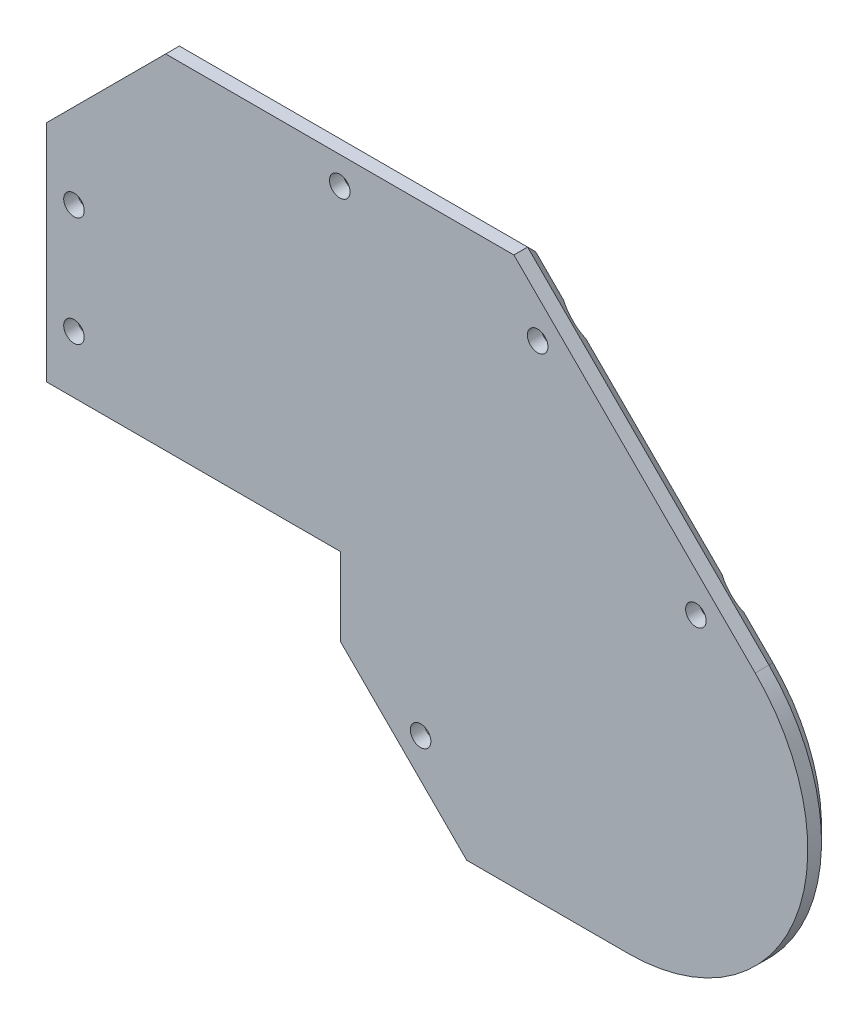
ISO-10303-21;
HEADER;
FILE_DESCRIPTION(('STEP AP214'),'2;1');
FILE_NAME('part.step','',(''),(''),'','','');
FILE_SCHEMA(('AUTOMOTIVE_DESIGN { 1 0 10303 214 1 1 1 1 }'));
ENDSEC;
DATA;
#1=APPLICATION_CONTEXT('core data for automotive mechanical design processes');
#2=APPLICATION_PROTOCOL_DEFINITION('international standard','automotive_design',2000,#1);
#3=PRODUCT_CONTEXT('',#1,'mechanical');
#4=PRODUCT('Part','Part','',(#3));
#5=PRODUCT_RELATED_PRODUCT_CATEGORY('part','',(#4));
#6=PRODUCT_DEFINITION_FORMATION('','',#4);
#7=PRODUCT_DEFINITION_CONTEXT('part definition',#1,'design');
#8=PRODUCT_DEFINITION('design','',#6,#7);
#9=PRODUCT_DEFINITION_SHAPE('','',#8);
#10=(LENGTH_UNIT() NAMED_UNIT(*) SI_UNIT(.MILLI.,.METRE.));
#11=(NAMED_UNIT(*) PLANE_ANGLE_UNIT() SI_UNIT($,.RADIAN.));
#12=(NAMED_UNIT(*) SI_UNIT($,.STERADIAN.) SOLID_ANGLE_UNIT());
#13=UNCERTAINTY_MEASURE_WITH_UNIT(LENGTH_MEASURE(1.E-05),#10,'distance_accuracy_value','');
#14=(GEOMETRIC_REPRESENTATION_CONTEXT(3) GLOBAL_UNCERTAINTY_ASSIGNED_CONTEXT((#13)) GLOBAL_UNIT_ASSIGNED_CONTEXT((#10,
#11,#12)) REPRESENTATION_CONTEXT('',''));
#15=CARTESIAN_POINT('',(0.,0.,0.));
#16=DIRECTION('',(0.,0.,1.));
#17=DIRECTION('',(1.,0.,0.));
#18=AXIS2_PLACEMENT_3D('',#15,#16,#17);
#19=CARTESIAN_POINT('',(91.5686996380855,17.926841446616,-4.));
#20=DIRECTION('',(0.,0.,1.));
#21=DIRECTION('',(1.,0.,0.));
#22=AXIS2_PLACEMENT_3D('',#19,#20,#21);
#23=CYLINDRICAL_SURFACE('',#22,1.5);
#24=CARTESIAN_POINT('',(91.5686996380855,17.926841446616,0.));
#25=DIRECTION('',(0.,0.,-1.));
#26=DIRECTION('',(-1.,0.,0.));
#27=AXIS2_PLACEMENT_3D('',#24,#25,#26);
#28=CIRCLE('',#27,1.5);
#29=CARTESIAN_POINT('',(90.0686996380855,17.926841446616,0.));
#30=VERTEX_POINT('',#29);
#31=EDGE_CURVE('E354',#30,#30,#28,.T.);
#32=ORIENTED_EDGE('',*,*,#31,.F.);
#33=EDGE_LOOP('',(#32));
#34=FACE_BOUND('',#33,.T.);
#35=CARTESIAN_POINT('',(91.5686996380855,17.926841446616,-2.));
#36=DIRECTION('',(0.,0.,-1.));
#37=DIRECTION('',(-1.,0.,0.));
#38=AXIS2_PLACEMENT_3D('',#35,#36,#37);
#39=CIRCLE('',#38,1.5);
#40=CARTESIAN_POINT('',(90.0686996380855,17.926841446616,-2.));
#41=VERTEX_POINT('',#40);
#42=EDGE_CURVE('E37',#41,#41,#39,.T.);
#43=ORIENTED_EDGE('',*,*,#42,.T.);
#44=EDGE_LOOP('',(#43));
#45=FACE_BOUND('',#44,.T.);
#46=ADVANCED_FACE('F33',(#34,#45),#23,.F.);
#47=CARTESIAN_POINT('',(51.3882684270139,-17.4117315730127,-4.));
#48=DIRECTION('',(0.,0.,1.));
#49=DIRECTION('',(1.,0.,0.));
#50=AXIS2_PLACEMENT_3D('',#47,#48,#49);
#51=CYLINDRICAL_SURFACE('',#50,1.5);
#52=CARTESIAN_POINT('',(51.3882684270139,-17.4117315730127,0.));
#53=DIRECTION('',(0.,0.,-1.));
#54=DIRECTION('',(-1.,0.,0.));
#55=AXIS2_PLACEMENT_3D('',#52,#53,#54);
#56=CIRCLE('',#55,1.5);
#57=CARTESIAN_POINT('',(49.8882684270139,-17.4117315730127,0.));
#58=VERTEX_POINT('',#57);
#59=EDGE_CURVE('E342',#58,#58,#56,.T.);
#60=ORIENTED_EDGE('',*,*,#59,.F.);
#61=EDGE_LOOP('',(#60));
#62=FACE_BOUND('',#61,.T.);
#63=CARTESIAN_POINT('',(51.3882684270139,-17.4117315730127,-2.));
#64=DIRECTION('',(0.,0.,-1.));
#65=DIRECTION('',(-1.,0.,0.));
#66=AXIS2_PLACEMENT_3D('',#63,#64,#65);
#67=CIRCLE('',#66,1.5);
#68=CARTESIAN_POINT('',(49.8882684270139,-17.4117315730127,-2.));
#69=VERTEX_POINT('',#68);
#70=EDGE_CURVE('E298',#69,#69,#67,.T.);
#71=ORIENTED_EDGE('',*,*,#70,.T.);
#72=EDGE_LOOP('',(#71));
#73=FACE_BOUND('',#72,.T.);
#74=ADVANCED_FACE('F462',(#62,#73),#51,.F.);
#75=CARTESIAN_POINT('',(68.4726534900144,41.022887594687,-4.));
#76=DIRECTION('',(0.,0.,1.));
#77=DIRECTION('',(1.,0.,0.));
#78=AXIS2_PLACEMENT_3D('',#75,#76,#77);
#79=CYLINDRICAL_SURFACE('',#78,1.5);
#80=CARTESIAN_POINT('',(68.4726534900144,41.022887594687,0.));
#81=DIRECTION('',(0.,0.,-1.));
#82=DIRECTION('',(-1.,0.,0.));
#83=AXIS2_PLACEMENT_3D('',#80,#81,#82);
#84=CIRCLE('',#83,1.5);
#85=CARTESIAN_POINT('',(66.9726534900144,41.022887594687,0.));
#86=VERTEX_POINT('',#85);
#87=EDGE_CURVE('E351',#86,#86,#84,.T.);
#88=ORIENTED_EDGE('',*,*,#87,.F.);
#89=EDGE_LOOP('',(#88));
#90=FACE_BOUND('',#89,.T.);
#91=CARTESIAN_POINT('',(68.4726534900144,41.022887594687,-2.));
#92=DIRECTION('',(0.,0.,-1.));
#93=DIRECTION('',(-1.,0.,0.));
#94=AXIS2_PLACEMENT_3D('',#91,#92,#93);
#95=CIRCLE('',#94,1.5);
#96=CARTESIAN_POINT('',(66.9726534900144,41.022887594687,-2.));
#97=VERTEX_POINT('',#96);
#98=EDGE_CURVE('E292',#97,#97,#95,.T.);
#99=ORIENTED_EDGE('',*,*,#98,.T.);
#100=EDGE_LOOP('',(#99));
#101=FACE_BOUND('',#100,.T.);
#102=ADVANCED_FACE('F469',(#90,#101),#79,.F.);
#103=CARTESIAN_POINT('',(39.5924878405,46.1490147738,-4.));
#104=DIRECTION('',(0.,0.,1.));
#105=DIRECTION('',(1.,0.,0.));
#106=AXIS2_PLACEMENT_3D('',#103,#104,#105);
#107=CYLINDRICAL_SURFACE('',#106,1.5);
#108=CARTESIAN_POINT('',(39.5924878405,46.1490147738,0.));
#109=DIRECTION('',(0.,0.,-1.));
#110=DIRECTION('',(-1.,0.,0.));
#111=AXIS2_PLACEMENT_3D('',#108,#109,#110);
#112=CIRCLE('',#111,1.5);
#113=CARTESIAN_POINT('',(38.0924878405,46.1490147738,0.));
#114=VERTEX_POINT('',#113);
#115=EDGE_CURVE('E348',#114,#114,#112,.T.);
#116=ORIENTED_EDGE('',*,*,#115,.F.);
#117=EDGE_LOOP('',(#116));
#118=FACE_BOUND('',#117,.T.);
#119=CARTESIAN_POINT('',(39.5924878405,46.1490147738,-2.));
#120=DIRECTION('',(0.,0.,-1.));
#121=DIRECTION('',(-1.,0.,0.));
#122=AXIS2_PLACEMENT_3D('',#119,#120,#121);
#123=CIRCLE('',#122,1.5);
#124=CARTESIAN_POINT('',(38.0924878405,46.1490147738,-2.));
#125=VERTEX_POINT('',#124);
#126=EDGE_CURVE('E286',#125,#125,#123,.T.);
#127=ORIENTED_EDGE('',*,*,#126,.T.);
#128=EDGE_LOOP('',(#127));
#129=FACE_BOUND('',#128,.T.);
#130=ADVANCED_FACE('F608',(#118,#129),#107,.F.);
#131=CARTESIAN_POINT('',(0.8,8.38370982659695,-4.));
#132=DIRECTION('',(0.,0.,1.));
#133=DIRECTION('',(1.,0.,0.));
#134=AXIS2_PLACEMENT_3D('',#131,#132,#133);
#135=CYLINDRICAL_SURFACE('',#134,1.5);
#136=CARTESIAN_POINT('',(0.8,8.38370982659695,0.));
#137=DIRECTION('',(0.,0.,-1.));
#138=DIRECTION('',(-1.,0.,0.));
#139=AXIS2_PLACEMENT_3D('',#136,#137,#138);
#140=CIRCLE('',#139,1.5);
#141=CARTESIAN_POINT('',(-0.699999999999999,8.38370982659695,0.));
#142=VERTEX_POINT('',#141);
#143=EDGE_CURVE('E269',#142,#142,#140,.T.);
#144=ORIENTED_EDGE('',*,*,#143,.F.);
#145=EDGE_LOOP('',(#144));
#146=FACE_BOUND('',#145,.T.);
#147=CARTESIAN_POINT('',(0.8,8.38370982659695,-2.));
#148=DIRECTION('',(0.,0.,-1.));
#149=DIRECTION('',(-1.,0.,0.));
#150=AXIS2_PLACEMENT_3D('',#147,#148,#149);
#151=CIRCLE('',#150,1.5);
#152=CARTESIAN_POINT('',(-0.699999999999999,8.38370982659695,-2.));
#153=VERTEX_POINT('',#152);
#154=EDGE_CURVE('E279',#153,#153,#151,.T.);
#155=ORIENTED_EDGE('',*,*,#154,.T.);
#156=EDGE_LOOP('',(#155));
#157=FACE_BOUND('',#156,.T.);
#158=ADVANCED_FACE('F457',(#146,#157),#135,.F.);
#159=CARTESIAN_POINT('',(0.8,24.383709826597,-4.));
#160=DIRECTION('',(0.,0.,1.));
#161=DIRECTION('',(1.,0.,0.));
#162=AXIS2_PLACEMENT_3D('',#159,#160,#161);
#163=CYLINDRICAL_SURFACE('',#162,1.5);
#164=CARTESIAN_POINT('',(0.8,24.383709826597,0.));
#165=DIRECTION('',(0.,0.,-1.));
#166=DIRECTION('',(-1.,0.,0.));
#167=AXIS2_PLACEMENT_3D('',#164,#165,#166);
#168=CIRCLE('',#167,1.5);
#169=CARTESIAN_POINT('',(-0.7,24.383709826597,0.));
#170=VERTEX_POINT('',#169);
#171=EDGE_CURVE('E345',#170,#170,#168,.T.);
#172=ORIENTED_EDGE('',*,*,#171,.F.);
#173=EDGE_LOOP('',(#172));
#174=FACE_BOUND('',#173,.T.);
#175=CARTESIAN_POINT('',(0.8,24.383709826597,-2.));
#176=DIRECTION('',(0.,0.,-1.));
#177=DIRECTION('',(-1.,0.,0.));
#178=AXIS2_PLACEMENT_3D('',#175,#176,#177);
#179=CIRCLE('',#178,1.5);
#180=CARTESIAN_POINT('',(-0.7,24.383709826597,-2.));
#181=VERTEX_POINT('',#180);
#182=EDGE_CURVE('E272',#181,#181,#179,.T.);
#183=ORIENTED_EDGE('',*,*,#182,.T.);
#184=EDGE_LOOP('',(#183));
#185=FACE_BOUND('',#184,.T.);
#186=ADVANCED_FACE('F450',(#174,#185),#163,.F.);
#187=CARTESIAN_POINT('',(39.,0.,48.));
#188=DIRECTION('',(0.,1.,0.));
#189=DIRECTION('',(0.,0.,1.));
#190=AXIS2_PLACEMENT_3D('',#187,#188,#189);
#191=PLANE('',#190);
#192=DIRECTION('',(0.,0.,-1.));
#193=VECTOR('',#192,1.);
#194=CARTESIAN_POINT('',(39.7000000000247,0.,48.));
#195=LINE('',#194,#193);
#196=CARTESIAN_POINT('',(39.7000000000247,0.,0.));
#197=VERTEX_POINT('',#196);
#198=CARTESIAN_POINT('',(39.7000000000247,0.,-2.));
#199=VERTEX_POINT('',#198);
#200=EDGE_CURVE('E183',#197,#199,#195,.T.);
#201=ORIENTED_EDGE('',*,*,#200,.F.);
#202=DIRECTION('',(1.,0.,0.));
#203=VECTOR('',#202,1.);
#204=CARTESIAN_POINT('',(-3.2,0.,0.));
#205=LINE('',#204,#203);
#206=CARTESIAN_POINT('',(-3.2,0.,0.));
#207=VERTEX_POINT('',#206);
#208=EDGE_CURVE('E335',#207,#197,#205,.T.);
#209=ORIENTED_EDGE('',*,*,#208,.F.);
#210=DIRECTION('',(0.,0.,-1.));
#211=VECTOR('',#210,1.);
#212=CARTESIAN_POINT('',(-3.2,0.,48.));
#213=LINE('',#212,#211);
#214=CARTESIAN_POINT('',(-3.2,0.,-2.));
#215=VERTEX_POINT('',#214);
#216=EDGE_CURVE('E357',#207,#215,#213,.T.);
#217=ORIENTED_EDGE('',*,*,#216,.T.);
#218=DIRECTION('',(1.,0.,0.));
#219=VECTOR('',#218,1.);
#220=CARTESIAN_POINT('',(39.7000000000247,0.,-2.));
#221=LINE('',#220,#219);
#222=EDGE_CURVE('E224',#215,#199,#221,.T.);
#223=ORIENTED_EDGE('',*,*,#222,.T.);
#224=EDGE_LOOP('',(#201,#209,#217,#223));
#225=FACE_BOUND('',#224,.T.);
#226=ADVANCED_FACE('F447',(#225),#191,.F.);
#227=CARTESIAN_POINT('',(39.7000000000247,0.,48.));
#228=DIRECTION('',(1.,0.,0.));
#229=DIRECTION('',(0.,0.,-1.));
#230=AXIS2_PLACEMENT_3D('',#227,#228,#229);
#231=PLANE('',#230);
#232=DIRECTION('',(0.,0.,-1.));
#233=VECTOR('',#232,1.);
#234=CARTESIAN_POINT('',(39.7000000000247,-11.3803173955159,48.));
#235=LINE('',#234,#233);
#236=CARTESIAN_POINT('',(39.7000000000247,-11.3803173955159,0.));
#237=VERTEX_POINT('',#236);
#238=CARTESIAN_POINT('',(39.7000000000247,-11.3803173955159,-2.));
#239=VERTEX_POINT('',#238);
#240=EDGE_CURVE('E186',#237,#239,#235,.T.);
#241=ORIENTED_EDGE('',*,*,#240,.F.);
#242=DIRECTION('',(0.,-1.,0.));
#243=VECTOR('',#242,1.);
#244=CARTESIAN_POINT('',(39.7000000000247,0.,0.));
#245=LINE('',#244,#243);
#246=EDGE_CURVE('E333',#197,#237,#245,.T.);
#247=ORIENTED_EDGE('',*,*,#246,.F.);
#248=ORIENTED_EDGE('',*,*,#200,.T.);
#249=DIRECTION('',(0.,-1.,0.));
#250=VECTOR('',#249,1.);
#251=CARTESIAN_POINT('',(39.7000000000247,-11.3803173955159,-2.));
#252=LINE('',#251,#250);
#253=EDGE_CURVE('E227',#199,#239,#252,.T.);
#254=ORIENTED_EDGE('',*,*,#253,.T.);
#255=EDGE_LOOP('',(#241,#247,#248,#254));
#256=FACE_BOUND('',#255,.T.);
#257=ADVANCED_FACE('F382',(#256),#231,.F.);
#258=CARTESIAN_POINT('',(50.1824243043077,-21.8627416997989,48.));
#259=DIRECTION('',(0.707106781186548,0.707106781186547,0.));
#260=DIRECTION('',(-0.707106781186547,0.707106781186548,0.));
#261=AXIS2_PLACEMENT_3D('',#258,#259,#260);
#262=PLANE('',#261);
#263=DIRECTION('',(0.,0.,-1.));
#264=VECTOR('',#263,1.);
#265=CARTESIAN_POINT('',(58.1196826045108,-29.800000000002,48.));
#266=LINE('',#265,#264);
#267=CARTESIAN_POINT('',(58.1196826045108,-29.800000000002,0.));
#268=VERTEX_POINT('',#267);
#269=CARTESIAN_POINT('',(58.1196826045108,-29.800000000002,-2.));
#270=VERTEX_POINT('',#269);
#271=EDGE_CURVE('E369',#268,#270,#266,.T.);
#272=ORIENTED_EDGE('',*,*,#271,.F.);
#273=DIRECTION('',(0.707106781186548,-0.707106781186548,0.));
#274=VECTOR('',#273,1.);
#275=CARTESIAN_POINT('',(39.7000000000247,-11.3803173955159,0.));
#276=LINE('',#275,#274);
#277=EDGE_CURVE('E331',#237,#268,#276,.T.);
#278=ORIENTED_EDGE('',*,*,#277,.F.);
#279=ORIENTED_EDGE('',*,*,#240,.T.);
#280=DIRECTION('',(0.707106781186547,-0.707106781186548,0.));
#281=VECTOR('',#280,1.);
#282=CARTESIAN_POINT('',(58.1196826045108,-29.800000000002,-2.));
#283=LINE('',#282,#281);
#284=EDGE_CURVE('E230',#239,#270,#283,.T.);
#285=ORIENTED_EDGE('',*,*,#284,.T.);
#286=EDGE_LOOP('',(#272,#278,#279,#285));
#287=FACE_BOUND('',#286,.T.);
#288=ADVANCED_FACE('F375',(#287),#262,.F.);
#289=CARTESIAN_POINT('',(81.7000000000047,-29.800000000002,48.));
#290=DIRECTION('',(0.,1.,0.));
#291=DIRECTION('',(-1.,0.,0.));
#292=AXIS2_PLACEMENT_3D('',#289,#290,#291);
#293=PLANE('',#292);
#294=DIRECTION('',(0.,0.,-1.));
#295=VECTOR('',#294,1.);
#296=CARTESIAN_POINT('',(81.7000000000047,-29.800000000002,48.));
#297=LINE('',#296,#295);
#298=CARTESIAN_POINT('',(81.7000000000047,-29.800000000002,0.));
#299=VERTEX_POINT('',#298);
#300=CARTESIAN_POINT('',(81.7000000000047,-29.800000000002,-2.));
#301=VERTEX_POINT('',#300);
#302=EDGE_CURVE('E367',#299,#301,#297,.T.);
#303=ORIENTED_EDGE('',*,*,#302,.F.);
#304=DIRECTION('',(1.,0.,0.));
#305=VECTOR('',#304,1.);
#306=CARTESIAN_POINT('',(58.1196826045108,-29.800000000002,0.));
#307=LINE('',#306,#305);
#308=EDGE_CURVE('E329',#268,#299,#307,.T.);
#309=ORIENTED_EDGE('',*,*,#308,.F.);
#310=ORIENTED_EDGE('',*,*,#271,.T.);
#311=DIRECTION('',(1.,0.,0.));
#312=VECTOR('',#311,1.);
#313=CARTESIAN_POINT('',(81.7000000000047,-29.800000000002,-2.));
#314=LINE('',#313,#312);
#315=EDGE_CURVE('E233',#270,#301,#314,.T.);
#316=ORIENTED_EDGE('',*,*,#315,.T.);
#317=EDGE_LOOP('',(#303,#309,#310,#316));
#318=FACE_BOUND('',#317,.T.);
#319=ADVANCED_FACE('F398',(#318),#293,.F.);
#320=CARTESIAN_POINT('',(81.7000000000047,-3.59999999999532,48.));
#321=DIRECTION('',(0.,0.,-1.));
#322=DIRECTION('',(-1.,0.,0.));
#323=AXIS2_PLACEMENT_3D('',#320,#321,#322);
#324=CYLINDRICAL_SURFACE('',#323,26.2000000000067);
#325=DIRECTION('',(0.,0.,-1.));
#326=VECTOR('',#325,1.);
#327=CARTESIAN_POINT('',(100.226197667097,14.9261976670969,48.));
#328=LINE('',#327,#326);
#329=CARTESIAN_POINT('',(100.226197667097,14.9261976670969,0.));
#330=VERTEX_POINT('',#329);
#331=CARTESIAN_POINT('',(100.226197667097,14.9261976670969,-2.00000000000001));
#332=VERTEX_POINT('',#331);
#333=EDGE_CURVE('E365',#330,#332,#328,.T.);
#334=ORIENTED_EDGE('',*,*,#333,.F.);
#335=CARTESIAN_POINT('',(81.7000000000047,-3.59999999999532,0.));
#336=DIRECTION('',(0.,0.,-1.));
#337=DIRECTION('',(-1.,0.,0.));
#338=AXIS2_PLACEMENT_3D('',#335,#336,#337);
#339=CIRCLE('',#338,26.2000000000067);
#340=EDGE_CURVE('E327',#299,#330,#339,.F.);
#341=ORIENTED_EDGE('',*,*,#340,.F.);
#342=ORIENTED_EDGE('',*,*,#302,.T.);
#343=CARTESIAN_POINT('',(81.7000000000047,-3.59999999999532,-2.));
#344=DIRECTION('',(0.,0.,-1.));
#345=DIRECTION('',(-1.,0.,0.));
#346=AXIS2_PLACEMENT_3D('',#343,#344,#345);
#347=CIRCLE('',#346,26.2000000000067);
#348=EDGE_CURVE('E236',#301,#332,#347,.F.);
#349=ORIENTED_EDGE('',*,*,#348,.T.);
#350=EDGE_LOOP('',(#334,#341,#342,#349));
#351=FACE_BOUND('',#350,.T.);
#352=ADVANCED_FACE('F406',(#351),#324,.T.);
#353=CARTESIAN_POINT('',(100.226197667097,14.9261976670969,48.));
#354=DIRECTION('',(-0.707106781186548,-0.707106781186547,0.));
#355=DIRECTION('',(0.707106781186547,-0.707106781186548,0.));
#356=AXIS2_PLACEMENT_3D('',#353,#354,#355);
#357=PLANE('',#356);
#358=DIRECTION('',(0.,0.,-1.));
#359=VECTOR('',#358,1.);
#360=CARTESIAN_POINT('',(65.0033805603939,50.1490147738,48.));
#361=LINE('',#360,#359);
#362=CARTESIAN_POINT('',(65.0033805603939,50.1490147738,0.));
#363=VERTEX_POINT('',#362);
#364=CARTESIAN_POINT('',(65.0033805603939,50.1490147738,-2.00000000000001));
#365=VERTEX_POINT('',#364);
#366=EDGE_CURVE('E363',#363,#365,#361,.T.);
#367=ORIENTED_EDGE('',*,*,#366,.F.);
#368=DIRECTION('',(-0.707106781186547,0.707106781186548,0.));
#369=VECTOR('',#368,1.);
#370=CARTESIAN_POINT('',(100.226197667097,14.9261976670969,0.));
#371=LINE('',#370,#369);
#372=EDGE_CURVE('E247',#330,#363,#371,.T.);
#373=ORIENTED_EDGE('',*,*,#372,.F.);
#374=ORIENTED_EDGE('',*,*,#333,.T.);
#375=DIRECTION('',(-0.707106781186547,0.707106781186548,0.));
#376=VECTOR('',#375,1.);
#377=CARTESIAN_POINT('',(65.0033805603939,50.1490147738,-2.00000000000001));
#378=LINE('',#377,#376);
#379=EDGE_CURVE('E239',#332,#365,#378,.T.);
#380=ORIENTED_EDGE('',*,*,#379,.T.);
#381=EDGE_LOOP('',(#367,#373,#374,#380));
#382=FACE_BOUND('',#381,.T.);
#383=ADVANCED_FACE('F409',(#382),#357,.F.);
#384=CARTESIAN_POINT('',(50.1111403346,50.1490147738,48.));
#385=DIRECTION('',(0.,-1.,0.));
#386=DIRECTION('',(0.,0.,-1.));
#387=AXIS2_PLACEMENT_3D('',#384,#385,#386);
#388=PLANE('',#387);
#389=DIRECTION('',(0.,0.,-1.));
#390=VECTOR('',#389,1.);
#391=CARTESIAN_POINT('',(14.1815951206061,50.1490147738,48.));
#392=LINE('',#391,#390);
#393=CARTESIAN_POINT('',(14.1815951206061,50.1490147738,0.));
#394=VERTEX_POINT('',#393);
#395=CARTESIAN_POINT('',(14.1815951206061,50.1490147738,-2.));
#396=VERTEX_POINT('',#395);
#397=EDGE_CURVE('E361',#394,#396,#392,.T.);
#398=ORIENTED_EDGE('',*,*,#397,.F.);
#399=DIRECTION('',(-1.,0.,0.));
#400=VECTOR('',#399,1.);
#401=CARTESIAN_POINT('',(65.0033805603939,50.1490147738,0.));
#402=LINE('',#401,#400);
#403=EDGE_CURVE('E275',#363,#394,#402,.T.);
#404=ORIENTED_EDGE('',*,*,#403,.F.);
#405=ORIENTED_EDGE('',*,*,#366,.T.);
#406=DIRECTION('',(-1.,0.,0.));
#407=VECTOR('',#406,1.);
#408=CARTESIAN_POINT('',(14.1815951206061,50.1490147738,-2.));
#409=LINE('',#408,#407);
#410=EDGE_CURVE('E215',#365,#396,#409,.T.);
#411=ORIENTED_EDGE('',*,*,#410,.T.);
#412=EDGE_LOOP('',(#398,#404,#405,#411));
#413=FACE_BOUND('',#412,.T.);
#414=ADVANCED_FACE('F415',(#413),#388,.F.);
#415=CARTESIAN_POINT('',(-3.2,32.7674196531939,48.));
#416=DIRECTION('',(0.707106781186547,-0.707106781186547,0.));
#417=DIRECTION('',(0.707106781186548,0.707106781186548,0.));
#418=AXIS2_PLACEMENT_3D('',#415,#416,#417);
#419=PLANE('',#418);
#420=DIRECTION('',(0.,0.,-1.));
#421=VECTOR('',#420,1.);
#422=CARTESIAN_POINT('',(-3.2,32.7674196531939,48.));
#423=LINE('',#422,#421);
#424=CARTESIAN_POINT('',(-3.2,32.7674196531939,0.));
#425=VERTEX_POINT('',#424);
#426=CARTESIAN_POINT('',(-3.2,32.7674196531939,-2.));
#427=VERTEX_POINT('',#426);
#428=EDGE_CURVE('E359',#425,#427,#423,.T.);
#429=ORIENTED_EDGE('',*,*,#428,.F.);
#430=DIRECTION('',(-0.707106781186548,-0.707106781186548,0.));
#431=VECTOR('',#430,1.);
#432=CARTESIAN_POINT('',(14.1815951206061,50.1490147738,0.));
#433=LINE('',#432,#431);
#434=EDGE_CURVE('E325',#394,#425,#433,.T.);
#435=ORIENTED_EDGE('',*,*,#434,.F.);
#436=ORIENTED_EDGE('',*,*,#397,.T.);
#437=DIRECTION('',(-0.707106781186548,-0.707106781186548,0.));
#438=VECTOR('',#437,1.);
#439=CARTESIAN_POINT('',(-3.2,32.7674196531939,-2.));
#440=LINE('',#439,#438);
#441=EDGE_CURVE('E218',#396,#427,#440,.T.);
#442=ORIENTED_EDGE('',*,*,#441,.T.);
#443=EDGE_LOOP('',(#429,#435,#436,#442));
#444=FACE_BOUND('',#443,.T.);
#445=ADVANCED_FACE('F418',(#444),#419,.F.);
#446=CARTESIAN_POINT('',(-3.2,0.,48.));
#447=DIRECTION('',(1.,0.,0.));
#448=DIRECTION('',(0.,0.,-1.));
#449=AXIS2_PLACEMENT_3D('',#446,#447,#448);
#450=PLANE('',#449);
#451=ORIENTED_EDGE('',*,*,#216,.F.);
#452=DIRECTION('',(0.,-1.,0.));
#453=VECTOR('',#452,1.);
#454=CARTESIAN_POINT('',(-3.2,32.7674196531939,0.));
#455=LINE('',#454,#453);
#456=EDGE_CURVE('E337',#425,#207,#455,.T.);
#457=ORIENTED_EDGE('',*,*,#456,.F.);
#458=ORIENTED_EDGE('',*,*,#428,.T.);
#459=DIRECTION('',(0.,-1.,0.));
#460=VECTOR('',#459,1.);
#461=CARTESIAN_POINT('',(-3.2,0.,-2.));
#462=LINE('',#461,#460);
#463=EDGE_CURVE('E221',#427,#215,#462,.T.);
#464=ORIENTED_EDGE('',*,*,#463,.T.);
#465=EDGE_LOOP('',(#451,#457,#458,#464));
#466=FACE_BOUND('',#465,.T.);
#467=ADVANCED_FACE('F441',(#466),#450,.F.);
#468=CARTESIAN_POINT('',(81.7000000000047,-3.59999999999532,-4.));
#469=DIRECTION('',(0.,0.,-1.));
#470=DIRECTION('',(-1.,0.,0.));
#471=AXIS2_PLACEMENT_3D('',#468,#469,#470);
#472=PLANE('',#471);
#473=CARTESIAN_POINT('',(91.5686996380855,17.926841446616,-4.));
#474=DIRECTION('',(0.,0.,-1.));
#475=DIRECTION('',(-1.,0.,0.));
#476=AXIS2_PLACEMENT_3D('',#473,#474,#475);
#477=CIRCLE('',#476,3.00000000000001);
#478=CARTESIAN_POINT('',(94.5640520305428,17.7599161789049,-4.));
#479=VERTEX_POINT('',#478);
#480=CARTESIAN_POINT('',(91.4017743703744,20.9221938390733,-4.));
#481=VERTEX_POINT('',#480);
#482=EDGE_CURVE('E47',#479,#481,#477,.T.);
#483=ORIENTED_EDGE('',*,*,#482,.F.);
#484=DIRECTION('',(0.707106781186547,-0.707106781186548,0.));
#485=VECTOR('',#484,1.);
#486=CARTESIAN_POINT('',(98.8119841047239,13.5119841047238,-4.));
#487=LINE('',#486,#485);
#488=CARTESIAN_POINT('',(98.8119841047239,13.5119841047238,-4.));
#489=VERTEX_POINT('',#488);
#490=EDGE_CURVE('E172',#479,#489,#487,.T.);
#491=ORIENTED_EDGE('',*,*,#490,.T.);
#492=CARTESIAN_POINT('',(81.7000000000047,-3.59999999999532,-4.));
#493=DIRECTION('',(0.,0.,-1.));
#494=DIRECTION('',(-1.,0.,0.));
#495=AXIS2_PLACEMENT_3D('',#492,#493,#494);
#496=CIRCLE('',#495,24.2000000000067);
#497=CARTESIAN_POINT('',(81.7000000000047,-27.800000000002,-4.));
#498=VERTEX_POINT('',#497);
#499=EDGE_CURVE('E190',#489,#498,#496,.T.);
#500=ORIENTED_EDGE('',*,*,#499,.T.);
#501=DIRECTION('',(-1.,0.,0.));
#502=VECTOR('',#501,1.);
#503=CARTESIAN_POINT('',(58.1196826045108,-27.800000000002,-4.));
#504=LINE('',#503,#502);
#505=CARTESIAN_POINT('',(58.948109729257,-27.800000000002,-4.));
#506=VERTEX_POINT('',#505);
#507=EDGE_CURVE('E192',#498,#506,#504,.T.);
#508=ORIENTED_EDGE('',*,*,#507,.T.);
#509=DIRECTION('',(-0.707106781186547,0.707106781186548,0.));
#510=VECTOR('',#509,1.);
#511=CARTESIAN_POINT('',(41.1142135623978,-9.96610383314278,-4.));
#512=LINE('',#511,#510);
#513=CARTESIAN_POINT('',(51.555193694725,-20.40708396547,-4.));
#514=VERTEX_POINT('',#513);
#515=EDGE_CURVE('E197',#506,#514,#512,.T.);
#516=ORIENTED_EDGE('',*,*,#515,.T.);
#517=CARTESIAN_POINT('',(51.3882684270139,-17.4117315730127,-4.));
#518=DIRECTION('',(0.,0.,-1.));
#519=DIRECTION('',(-1.,0.,0.));
#520=AXIS2_PLACEMENT_3D('',#517,#518,#519);
#521=CIRCLE('',#520,3.);
#522=CARTESIAN_POINT('',(48.3929160345566,-17.2448063053017,-4.));
#523=VERTEX_POINT('',#522);
#524=EDGE_CURVE('E54',#523,#514,#521,.T.);
#525=ORIENTED_EDGE('',*,*,#524,.F.);
#526=CARTESIAN_POINT('',(41.7000000000247,-10.5518902707697,-4.));
#527=VERTEX_POINT('',#526);
#528=EDGE_CURVE('E194',#523,#527,#512,.T.);
#529=ORIENTED_EDGE('',*,*,#528,.T.);
#530=DIRECTION('',(0.,1.,0.));
#531=VECTOR('',#530,1.);
#532=CARTESIAN_POINT('',(41.7000000000247,0.,-4.));
#533=LINE('',#532,#531);
#534=CARTESIAN_POINT('',(41.7000000000247,2.,-4.));
#535=VERTEX_POINT('',#534);
#536=EDGE_CURVE('E200',#527,#535,#533,.T.);
#537=ORIENTED_EDGE('',*,*,#536,.T.);
#538=DIRECTION('',(-1.,0.,0.));
#539=VECTOR('',#538,1.);
#540=CARTESIAN_POINT('',(-3.2,2.,-4.));
#541=LINE('',#540,#539);
#542=CARTESIAN_POINT('',(-1.20000000000001,2.,-4.));
#543=VERTEX_POINT('',#542);
#544=EDGE_CURVE('E202',#535,#543,#541,.T.);
#545=ORIENTED_EDGE('',*,*,#544,.T.);
#546=DIRECTION('',(0.,1.,0.));
#547=VECTOR('',#546,1.);
#548=CARTESIAN_POINT('',(-1.20000000000001,32.7674196531939,-4.));
#549=LINE('',#548,#547);
#550=CARTESIAN_POINT('',(-1.20000000000001,6.14764184909717,-4.));
#551=VERTEX_POINT('',#550);
#552=EDGE_CURVE('E205',#543,#551,#549,.T.);
#553=ORIENTED_EDGE('',*,*,#552,.T.);
#554=CARTESIAN_POINT('',(0.8,8.38370982659695,-4.));
#555=DIRECTION('',(0.,0.,-1.));
#556=DIRECTION('',(-1.,0.,0.));
#557=AXIS2_PLACEMENT_3D('',#554,#555,#556);
#558=CIRCLE('',#557,3.);
#559=CARTESIAN_POINT('',(-1.20000000000001,10.6197778040967,-4.));
#560=VERTEX_POINT('',#559);
#561=EDGE_CURVE('E289',#560,#551,#558,.T.);
#562=ORIENTED_EDGE('',*,*,#561,.F.);
#563=CARTESIAN_POINT('',(-1.20000000000001,22.1476418490972,-4.));
#564=VERTEX_POINT('',#563);
#565=EDGE_CURVE('E209',#560,#564,#549,.T.);
#566=ORIENTED_EDGE('',*,*,#565,.T.);
#567=CARTESIAN_POINT('',(0.8,24.383709826597,-4.));
#568=DIRECTION('',(0.,0.,-1.));
#569=DIRECTION('',(-1.,0.,0.));
#570=AXIS2_PLACEMENT_3D('',#567,#568,#569);
#571=CIRCLE('',#570,3.);
#572=CARTESIAN_POINT('',(-1.20000000000001,26.6197778040967,-4.));
#573=VERTEX_POINT('',#572);
#574=EDGE_CURVE('E282',#573,#564,#571,.T.);
#575=ORIENTED_EDGE('',*,*,#574,.F.);
#576=CARTESIAN_POINT('',(-1.20000000000001,31.9389925284477,-4.));
#577=VERTEX_POINT('',#576);
#578=EDGE_CURVE('E204',#573,#577,#549,.T.);
#579=ORIENTED_EDGE('',*,*,#578,.T.);
#580=DIRECTION('',(0.707106781186548,0.707106781186548,0.));
#581=VECTOR('',#580,1.);
#582=CARTESIAN_POINT('',(15.5958086829792,48.7348012114269,-4.));
#583=LINE('',#582,#581);
#584=CARTESIAN_POINT('',(15.0100222453523,48.1490147738,-4.));
#585=VERTEX_POINT('',#584);
#586=EDGE_CURVE('E208',#577,#585,#583,.T.);
#587=ORIENTED_EDGE('',*,*,#586,.T.);
#588=DIRECTION('',(1.,0.,0.));
#589=VECTOR('',#588,1.);
#590=CARTESIAN_POINT('',(65.0033805603939,48.1490147738,-4.));
#591=LINE('',#590,#589);
#592=CARTESIAN_POINT('',(37.3564198630002,48.1490147738,-4.));
#593=VERTEX_POINT('',#592);
#594=EDGE_CURVE('E212',#585,#593,#591,.T.);
#595=ORIENTED_EDGE('',*,*,#594,.T.);
#596=CARTESIAN_POINT('',(39.5924878405,46.1490147738,-4.));
#597=DIRECTION('',(0.,0.,-1.));
#598=DIRECTION('',(-1.,0.,0.));
#599=AXIS2_PLACEMENT_3D('',#596,#597,#598);
#600=CIRCLE('',#599,3.);
#601=CARTESIAN_POINT('',(41.8285558179998,48.1490147738,-4.));
#602=VERTEX_POINT('',#601);
#603=EDGE_CURVE('E295',#602,#593,#600,.T.);
#604=ORIENTED_EDGE('',*,*,#603,.F.);
#605=CARTESIAN_POINT('',(64.1749534356477,48.1490147738,-4.));
#606=VERTEX_POINT('',#605);
#607=EDGE_CURVE('E211',#602,#606,#591,.T.);
#608=ORIENTED_EDGE('',*,*,#607,.T.);
#609=CARTESIAN_POINT('',(68.3057282223034,44.0182399871443,-4.));
#610=VERTEX_POINT('',#609);
#611=EDGE_CURVE('E185',#606,#610,#487,.T.);
#612=ORIENTED_EDGE('',*,*,#611,.T.);
#613=CARTESIAN_POINT('',(68.4726534900144,41.022887594687,-4.));
#614=DIRECTION('',(0.,0.,-1.));
#615=DIRECTION('',(-1.,0.,0.));
#616=AXIS2_PLACEMENT_3D('',#613,#614,#615);
#617=CIRCLE('',#616,3.00000000000001);
#618=CARTESIAN_POINT('',(71.4680058824717,40.855962326976,-4.));
#619=VERTEX_POINT('',#618);
#620=EDGE_CURVE('E300',#619,#610,#617,.T.);
#621=ORIENTED_EDGE('',*,*,#620,.F.);
#622=EDGE_CURVE('E175',#619,#481,#487,.T.);
#623=ORIENTED_EDGE('',*,*,#622,.T.);
#624=EDGE_LOOP('',(#483,#491,#500,#508,#516,#525,#529,#537,#545,#553,#562,#566,#575,#579,#587,
#595,#604,#608,#612,#621,#623));
#625=FACE_BOUND('',#624,.T.);
#626=ADVANCED_FACE('F171',(#625),#472,.T.);
#627=CARTESIAN_POINT('',(81.7000000000047,-3.59999999999532,0.));
#628=DIRECTION('',(0.,0.,-1.));
#629=DIRECTION('',(-1.,0.,0.));
#630=AXIS2_PLACEMENT_3D('',#627,#628,#629);
#631=PLANE('',#630);
#632=ORIENTED_EDGE('',*,*,#87,.T.);
#633=EDGE_LOOP('',(#632));
#634=FACE_BOUND('',#633,.T.);
#635=ORIENTED_EDGE('',*,*,#59,.T.);
#636=EDGE_LOOP('',(#635));
#637=FACE_BOUND('',#636,.T.);
#638=ORIENTED_EDGE('',*,*,#31,.T.);
#639=EDGE_LOOP('',(#638));
#640=FACE_BOUND('',#639,.T.);
#641=ORIENTED_EDGE('',*,*,#115,.T.);
#642=EDGE_LOOP('',(#641));
#643=FACE_BOUND('',#642,.T.);
#644=ORIENTED_EDGE('',*,*,#171,.T.);
#645=EDGE_LOOP('',(#644));
#646=FACE_BOUND('',#645,.T.);
#647=ORIENTED_EDGE('',*,*,#143,.T.);
#648=EDGE_LOOP('',(#647));
#649=FACE_BOUND('',#648,.T.);
#650=ORIENTED_EDGE('',*,*,#372,.T.);
#651=ORIENTED_EDGE('',*,*,#403,.T.);
#652=ORIENTED_EDGE('',*,*,#434,.T.);
#653=ORIENTED_EDGE('',*,*,#456,.T.);
#654=ORIENTED_EDGE('',*,*,#208,.T.);
#655=ORIENTED_EDGE('',*,*,#246,.T.);
#656=ORIENTED_EDGE('',*,*,#277,.T.);
#657=ORIENTED_EDGE('',*,*,#308,.T.);
#658=ORIENTED_EDGE('',*,*,#340,.T.);
#659=EDGE_LOOP('',(#650,#651,#652,#653,#654,#655,#656,#657,#658));
#660=FACE_BOUND('',#659,.T.);
#661=ADVANCED_FACE('F402',(#634,#637,#640,#643,#646,#649,#660),#631,.F.);
#662=CARTESIAN_POINT('',(41.7000000000247,-3.59999999999532,-4.));
#663=DIRECTION('',(-0.707106781186548,0.,-0.707106781186547));
#664=DIRECTION('',(0.,-1.,0.));
#665=AXIS2_PLACEMENT_3D('',#662,#663,#664);
#666=PLANE('',#665);
#667=DIRECTION('',(0.577350269189625,0.577350269189626,-0.577350269189626));
#668=VECTOR('',#667,1.);
#669=CARTESIAN_POINT('',(55.0333333333513,15.3333333333266,-17.3333333333267));
#670=LINE('',#669,#668);
#671=EDGE_CURVE('E263',#535,#199,#670,.F.);
#672=ORIENTED_EDGE('',*,*,#671,.F.);
#673=ORIENTED_EDGE('',*,*,#536,.F.);
#674=DIRECTION('',(0.678598344545847,0.281084637714819,-0.678598344545848));
#675=VECTOR('',#674,1.);
#676=CARTESIAN_POINT('',(46.1573992172422,-8.70557506208695,-8.45739921721757));
#677=LINE('',#676,#675);
#678=EDGE_CURVE('E266',#239,#527,#677,.T.);
#679=ORIENTED_EDGE('',*,*,#678,.F.);
#680=ORIENTED_EDGE('',*,*,#253,.F.);
#681=EDGE_LOOP('',(#672,#673,#679,#680));
#682=FACE_BOUND('',#681,.T.);
#683=ADVANCED_FACE('F35',(#682),#666,.T.);
#684=CARTESIAN_POINT('',(58.2240548646275,-27.0759451353725,-4.));
#685=DIRECTION('',(-0.500000000000001,-0.5,-0.707106781186546));
#686=DIRECTION('',(0.707106781186547,-0.707106781186548,0.));
#687=AXIS2_PLACEMENT_3D('',#684,#685,#686);
#688=PLANE('',#687);
#689=CARTESIAN_POINT('',(51.3882684270139,-17.4117315730127,-6.00000000000002));
#690=DIRECTION('',(-0.500000000000001,-0.5,-0.707106781186546));
#691=DIRECTION('',(0.5,0.499999999999999,-0.707106781186549));
#692=AXIS2_PLACEMENT_3D('',#689,#690,#691);
#693=ELLIPSE('',#692,4.24264068711929,3.);
#694=EDGE_CURVE('E42',#514,#523,#693,.T.);
#695=ORIENTED_EDGE('',*,*,#694,.F.);
#696=ORIENTED_EDGE('',*,*,#515,.F.);
#697=DIRECTION('',(0.281084637714819,0.678598344545846,-0.678598344545848));
#698=VECTOR('',#697,1.);
#699=CARTESIAN_POINT('',(60.7457041253258,-23.4602232293667,-8.33977677063528));
#700=LINE('',#699,#698);
#701=EDGE_CURVE('E260',#270,#506,#700,.T.);
#702=ORIENTED_EDGE('',*,*,#701,.F.);
#703=ORIENTED_EDGE('',*,*,#284,.F.);
#704=ORIENTED_EDGE('',*,*,#678,.T.);
#705=ORIENTED_EDGE('',*,*,#528,.F.);
#706=EDGE_LOOP('',(#695,#696,#702,#703,#704,#705));
#707=FACE_BOUND('',#706,.T.);
#708=ADVANCED_FACE('F389',(#707),#688,.T.);
#709=CARTESIAN_POINT('',(81.7000000000047,2.,-4.));
#710=DIRECTION('',(0.,-0.707106781186548,-0.707106781186547));
#711=DIRECTION('',(1.,0.,0.));
#712=AXIS2_PLACEMENT_3D('',#709,#710,#711);
#713=PLANE('',#712);
#714=ORIENTED_EDGE('',*,*,#671,.T.);
#715=ORIENTED_EDGE('',*,*,#222,.F.);
#716=DIRECTION('',(0.577350269189625,0.577350269189626,-0.577350269189627));
#717=VECTOR('',#716,1.);
#718=CARTESIAN_POINT('',(26.4333333333348,29.6333333333349,-31.6333333333349));
#719=LINE('',#718,#717);
#720=EDGE_CURVE('E257',#543,#215,#719,.F.);
#721=ORIENTED_EDGE('',*,*,#720,.F.);
#722=ORIENTED_EDGE('',*,*,#544,.F.);
#723=EDGE_LOOP('',(#714,#715,#721,#722));
#724=FACE_BOUND('',#723,.T.);
#725=ADVANCED_FACE('F444',(#724),#713,.T.);
#726=CARTESIAN_POINT('',(81.7000000000047,-27.800000000002,-4.));
#727=DIRECTION('',(0.,-0.707106781186548,-0.707106781186547));
#728=DIRECTION('',(1.,0.,0.));
#729=AXIS2_PLACEMENT_3D('',#726,#727,#728);
#730=PLANE('',#729);
#731=ORIENTED_EDGE('',*,*,#701,.T.);
#732=ORIENTED_EDGE('',*,*,#507,.F.);
#733=DIRECTION('',(0.,0.707106781186547,-0.707106781186548));
#734=VECTOR('',#733,1.);
#735=CARTESIAN_POINT('',(81.7000000000047,-29.800000000002,-2.));
#736=LINE('',#735,#734);
#737=EDGE_CURVE('E254',#301,#498,#736,.T.);
#738=ORIENTED_EDGE('',*,*,#737,.F.);
#739=ORIENTED_EDGE('',*,*,#315,.F.);
#740=EDGE_LOOP('',(#731,#732,#738,#739));
#741=FACE_BOUND('',#740,.T.);
#742=ADVANCED_FACE('F394',(#741),#730,.T.);
#743=CARTESIAN_POINT('',(-1.20000000000001,-3.59999999999532,-4.));
#744=DIRECTION('',(-0.707106781186548,0.,-0.707106781186547));
#745=DIRECTION('',(0.,-1.,0.));
#746=AXIS2_PLACEMENT_3D('',#743,#744,#745);
#747=PLANE('',#746);
#748=CARTESIAN_POINT('',(0.8,8.38370982659695,-6.00000000000001));
#749=DIRECTION('',(-0.707106781186548,0.,-0.707106781186547));
#750=DIRECTION('',(0.707106781186547,0.,-0.707106781186548));
#751=AXIS2_PLACEMENT_3D('',#748,#749,#750);
#752=ELLIPSE('',#751,4.24264068711929,3.);
#753=EDGE_CURVE('E271',#551,#560,#752,.T.);
#754=ORIENTED_EDGE('',*,*,#753,.F.);
#755=ORIENTED_EDGE('',*,*,#552,.F.);
#756=ORIENTED_EDGE('',*,*,#720,.T.);
#757=ORIENTED_EDGE('',*,*,#463,.F.);
#758=DIRECTION('',(0.678598344545845,-0.281084637714824,-0.678598344545847));
#759=VECTOR('',#758,1.);
#760=CARTESIAN_POINT('',(5.57883430305639,29.1311074230417,-10.7788343030564));
#761=LINE('',#760,#759);
#762=EDGE_CURVE('E251',#577,#427,#761,.F.);
#763=ORIENTED_EDGE('',*,*,#762,.F.);
#764=ORIENTED_EDGE('',*,*,#578,.F.);
#765=CARTESIAN_POINT('',(0.8,24.383709826597,-6.00000000000001));
#766=DIRECTION('',(-0.707106781186548,0.,-0.707106781186547));
#767=DIRECTION('',(0.707106781186547,0.,-0.707106781186548));
#768=AXIS2_PLACEMENT_3D('',#765,#766,#767);
#769=ELLIPSE('',#768,4.24264068711929,3.);
#770=EDGE_CURVE('E242',#564,#573,#769,.T.);
#771=ORIENTED_EDGE('',*,*,#770,.F.);
#772=ORIENTED_EDGE('',*,*,#565,.F.);
#773=EDGE_LOOP('',(#754,#755,#756,#757,#763,#764,#771,#772));
#774=FACE_BOUND('',#773,.T.);
#775=ADVANCED_FACE('F434',(#774),#747,.T.);
#776=CARTESIAN_POINT('',(81.7000000000047,-3.59999999999532,-4.));
#777=DIRECTION('',(0.,0.,1.));
#778=DIRECTION('',(1.,0.,0.));
#779=AXIS2_PLACEMENT_3D('',#776,#777,#778);
#780=CONICAL_SURFACE('',#779,24.2000000000067,0.785398163397447);
#781=ORIENTED_EDGE('',*,*,#737,.T.);
#782=ORIENTED_EDGE('',*,*,#499,.F.);
#783=DIRECTION('',(-0.499999999999999,-0.499999999999999,-0.707106781186549));
#784=VECTOR('',#783,1.);
#785=CARTESIAN_POINT('',(100.226197667097,14.9261976670969,-2.));
#786=LINE('',#785,#784);
#787=EDGE_CURVE('E182',#332,#489,#786,.T.);
#788=ORIENTED_EDGE('',*,*,#787,.F.);
#789=ORIENTED_EDGE('',*,*,#348,.F.);
#790=EDGE_LOOP('',(#781,#782,#788,#789));
#791=FACE_BOUND('',#790,.T.);
#792=ADVANCED_FACE('F565',(#791),#780,.T.);
#793=CARTESIAN_POINT('',(22.4805037357808,55.6194962642285,-4.));
#794=DIRECTION('',(-0.5,0.5,-0.707106781186548));
#795=DIRECTION('',(-0.707106781186548,-0.707106781186548,0.));
#796=AXIS2_PLACEMENT_3D('',#793,#794,#795);
#797=PLANE('',#796);
#798=ORIENTED_EDGE('',*,*,#762,.T.);
#799=ORIENTED_EDGE('',*,*,#441,.F.);
#800=DIRECTION('',(0.281084637714823,-0.678598344545846,-0.678598344545847));
#801=VECTOR('',#800,1.);
#802=CARTESIAN_POINT('',(14.1753080238746,50.164193167997,-1.98482160580296));
#803=LINE('',#802,#801);
#804=EDGE_CURVE('E246',#585,#396,#803,.F.);
#805=ORIENTED_EDGE('',*,*,#804,.F.);
#806=ORIENTED_EDGE('',*,*,#586,.F.);
#807=EDGE_LOOP('',(#798,#799,#805,#806));
#808=FACE_BOUND('',#807,.T.);
#809=ADVANCED_FACE('F429',(#808),#797,.T.);
#810=CARTESIAN_POINT('',(98.8119841047239,13.5119841047239,-4.));
#811=DIRECTION('',(0.5,0.5,-0.707106781186547));
#812=DIRECTION('',(-0.707106781186547,0.707106781186548,0.));
#813=AXIS2_PLACEMENT_3D('',#810,#811,#812);
#814=PLANE('',#813);
#815=CARTESIAN_POINT('',(91.5686996380855,17.926841446616,-5.99999999999999));
#816=DIRECTION('',(0.5,0.5,-0.707106781186547));
#817=DIRECTION('',(-0.5,-0.5,-0.707106781186548));
#818=AXIS2_PLACEMENT_3D('',#815,#816,#817);
#819=ELLIPSE('',#818,4.2426406871193,3.00000000000001);
#820=EDGE_CURVE('E11',#481,#479,#819,.T.);
#821=ORIENTED_EDGE('',*,*,#820,.F.);
#822=ORIENTED_EDGE('',*,*,#622,.F.);
#823=CARTESIAN_POINT('',(68.4726534900144,41.022887594687,-6.00000000000004));
#824=DIRECTION('',(0.5,0.5,-0.707106781186547));
#825=DIRECTION('',(-0.5,-0.5,-0.707106781186548));
#826=AXIS2_PLACEMENT_3D('',#823,#824,#825);
#827=ELLIPSE('',#826,4.2426406871193,3.00000000000001);
#828=EDGE_CURVE('E285',#610,#619,#827,.T.);
#829=ORIENTED_EDGE('',*,*,#828,.F.);
#830=ORIENTED_EDGE('',*,*,#611,.F.);
#831=DIRECTION('',(0.28108463771482,0.678598344545846,0.678598344545848));
#832=VECTOR('',#831,1.);
#833=CARTESIAN_POINT('',(60.3047849429905,38.8056015101579,-13.3434132636421));
#834=LINE('',#833,#832);
#835=EDGE_CURVE('E243',#365,#606,#834,.F.);
#836=ORIENTED_EDGE('',*,*,#835,.F.);
#837=ORIENTED_EDGE('',*,*,#379,.F.);
#838=ORIENTED_EDGE('',*,*,#787,.T.);
#839=ORIENTED_EDGE('',*,*,#490,.F.);
#840=EDGE_LOOP('',(#821,#822,#829,#830,#836,#837,#838,#839));
#841=FACE_BOUND('',#840,.T.);
#842=ADVANCED_FACE('F179',(#841),#814,.T.);
#843=CARTESIAN_POINT('',(81.7000000000047,48.1490147738,-4.));
#844=DIRECTION('',(0.,0.707106781186548,-0.707106781186547));
#845=DIRECTION('',(-1.,0.,0.));
#846=AXIS2_PLACEMENT_3D('',#843,#844,#845);
#847=PLANE('',#846);
#848=CARTESIAN_POINT('',(39.5924878405,46.1490147738,-6.00000000000001));
#849=DIRECTION('',(0.,0.707106781186548,-0.707106781186547));
#850=DIRECTION('',(0.,-0.707106781186547,-0.707106781186548));
#851=AXIS2_PLACEMENT_3D('',#848,#849,#850);
#852=ELLIPSE('',#851,4.24264068711929,3.);
#853=EDGE_CURVE('E278',#593,#602,#852,.T.);
#854=ORIENTED_EDGE('',*,*,#853,.F.);
#855=ORIENTED_EDGE('',*,*,#594,.F.);
#856=ORIENTED_EDGE('',*,*,#804,.T.);
#857=ORIENTED_EDGE('',*,*,#410,.F.);
#858=ORIENTED_EDGE('',*,*,#835,.T.);
#859=ORIENTED_EDGE('',*,*,#607,.F.);
#860=EDGE_LOOP('',(#854,#855,#856,#857,#858,#859));
#861=FACE_BOUND('',#860,.T.);
#862=ADVANCED_FACE('F425',(#861),#847,.T.);
#863=CARTESIAN_POINT('',(0.8,24.383709826597,-2.));
#864=DIRECTION('',(0.,0.,-1.));
#865=DIRECTION('',(-1.,0.,0.));
#866=AXIS2_PLACEMENT_3D('',#863,#864,#865);
#867=CYLINDRICAL_SURFACE('',#866,3.);
#868=ORIENTED_EDGE('',*,*,#770,.T.);
#869=ORIENTED_EDGE('',*,*,#574,.T.);
#870=EDGE_LOOP('',(#868,#869));
#871=FACE_BOUND('',#870,.T.);
#872=CARTESIAN_POINT('',(0.8,24.383709826597,-2.));
#873=DIRECTION('',(0.,0.,-1.));
#874=DIRECTION('',(-1.,0.,0.));
#875=AXIS2_PLACEMENT_3D('',#872,#873,#874);
#876=CIRCLE('',#875,3.);
#877=CARTESIAN_POINT('',(-2.2,24.383709826597,-2.));
#878=VERTEX_POINT('',#877);
#879=EDGE_CURVE('E276',#878,#878,#876,.T.);
#880=ORIENTED_EDGE('',*,*,#879,.F.);
#881=EDGE_LOOP('',(#880));
#882=FACE_BOUND('',#881,.T.);
#883=ADVANCED_FACE('F594',(#871,#882),#867,.F.);
#884=CARTESIAN_POINT('',(0.8,24.383709826597,-2.));
#885=DIRECTION('',(0.,0.,-1.));
#886=DIRECTION('',(-1.,0.,0.));
#887=AXIS2_PLACEMENT_3D('',#884,#885,#886);
#888=PLANE('',#887);
#889=ORIENTED_EDGE('',*,*,#182,.F.);
#890=EDGE_LOOP('',(#889));
#891=FACE_BOUND('',#890,.T.);
#892=ORIENTED_EDGE('',*,*,#879,.T.);
#893=EDGE_LOOP('',(#892));
#894=FACE_BOUND('',#893,.T.);
#895=ADVANCED_FACE('F639',(#891,#894),#888,.T.);
#896=CARTESIAN_POINT('',(0.8,8.38370982659695,-2.));
#897=DIRECTION('',(0.,0.,-1.));
#898=DIRECTION('',(-1.,0.,0.));
#899=AXIS2_PLACEMENT_3D('',#896,#897,#898);
#900=CYLINDRICAL_SURFACE('',#899,3.);
#901=ORIENTED_EDGE('',*,*,#753,.T.);
#902=ORIENTED_EDGE('',*,*,#561,.T.);
#903=EDGE_LOOP('',(#901,#902));
#904=FACE_BOUND('',#903,.T.);
#905=CARTESIAN_POINT('',(0.8,8.38370982659695,-2.));
#906=DIRECTION('',(0.,0.,-1.));
#907=DIRECTION('',(-1.,0.,0.));
#908=AXIS2_PLACEMENT_3D('',#905,#906,#907);
#909=CIRCLE('',#908,3.);
#910=CARTESIAN_POINT('',(-2.2,8.38370982659695,-2.));
#911=VERTEX_POINT('',#910);
#912=EDGE_CURVE('E283',#911,#911,#909,.T.);
#913=ORIENTED_EDGE('',*,*,#912,.F.);
#914=EDGE_LOOP('',(#913));
#915=FACE_BOUND('',#914,.T.);
#916=ADVANCED_FACE('F646',(#904,#915),#900,.F.);
#917=CARTESIAN_POINT('',(0.8,8.38370982659695,-2.));
#918=DIRECTION('',(0.,0.,-1.));
#919=DIRECTION('',(-1.,0.,0.));
#920=AXIS2_PLACEMENT_3D('',#917,#918,#919);
#921=PLANE('',#920);
#922=ORIENTED_EDGE('',*,*,#154,.F.);
#923=EDGE_LOOP('',(#922));
#924=FACE_BOUND('',#923,.T.);
#925=ORIENTED_EDGE('',*,*,#912,.T.);
#926=EDGE_LOOP('',(#925));
#927=FACE_BOUND('',#926,.T.);
#928=ADVANCED_FACE('F654',(#924,#927),#921,.T.);
#929=CARTESIAN_POINT('',(39.5924878405,46.1490147738,-2.));
#930=DIRECTION('',(0.,0.,-1.));
#931=DIRECTION('',(-1.,0.,0.));
#932=AXIS2_PLACEMENT_3D('',#929,#930,#931);
#933=CYLINDRICAL_SURFACE('',#932,3.);
#934=ORIENTED_EDGE('',*,*,#853,.T.);
#935=ORIENTED_EDGE('',*,*,#603,.T.);
#936=EDGE_LOOP('',(#934,#935));
#937=FACE_BOUND('',#936,.T.);
#938=CARTESIAN_POINT('',(39.5924878405,46.1490147738,-2.));
#939=DIRECTION('',(0.,0.,-1.));
#940=DIRECTION('',(-1.,0.,0.));
#941=AXIS2_PLACEMENT_3D('',#938,#939,#940);
#942=CIRCLE('',#941,3.);
#943=CARTESIAN_POINT('',(36.5924878405,46.1490147738,-2.));
#944=VERTEX_POINT('',#943);
#945=EDGE_CURVE('E290',#944,#944,#942,.T.);
#946=ORIENTED_EDGE('',*,*,#945,.F.);
#947=EDGE_LOOP('',(#946));
#948=FACE_BOUND('',#947,.T.);
#949=ADVANCED_FACE('F662',(#937,#948),#933,.F.);
#950=CARTESIAN_POINT('',(39.5924878405,46.1490147738,-2.));
#951=DIRECTION('',(0.,0.,-1.));
#952=DIRECTION('',(-1.,0.,0.));
#953=AXIS2_PLACEMENT_3D('',#950,#951,#952);
#954=PLANE('',#953);
#955=ORIENTED_EDGE('',*,*,#126,.F.);
#956=EDGE_LOOP('',(#955));
#957=FACE_BOUND('',#956,.T.);
#958=ORIENTED_EDGE('',*,*,#945,.T.);
#959=EDGE_LOOP('',(#958));
#960=FACE_BOUND('',#959,.T.);
#961=ADVANCED_FACE('F670',(#957,#960),#954,.T.);
#962=CARTESIAN_POINT('',(68.4726534900144,41.022887594687,-2.));
#963=DIRECTION('',(0.,0.,-1.));
#964=DIRECTION('',(-1.,0.,0.));
#965=AXIS2_PLACEMENT_3D('',#962,#963,#964);
#966=CYLINDRICAL_SURFACE('',#965,3.00000000000001);
#967=ORIENTED_EDGE('',*,*,#828,.T.);
#968=ORIENTED_EDGE('',*,*,#620,.T.);
#969=EDGE_LOOP('',(#967,#968));
#970=FACE_BOUND('',#969,.T.);
#971=CARTESIAN_POINT('',(68.4726534900144,41.022887594687,-2.));
#972=DIRECTION('',(0.,0.,-1.));
#973=DIRECTION('',(-1.,0.,0.));
#974=AXIS2_PLACEMENT_3D('',#971,#972,#973);
#975=CIRCLE('',#974,3.00000000000001);
#976=CARTESIAN_POINT('',(65.4726534900144,41.022887594687,-2.));
#977=VERTEX_POINT('',#976);
#978=EDGE_CURVE('E296',#977,#977,#975,.T.);
#979=ORIENTED_EDGE('',*,*,#978,.F.);
#980=EDGE_LOOP('',(#979));
#981=FACE_BOUND('',#980,.T.);
#982=ADVANCED_FACE('F678',(#970,#981),#966,.F.);
#983=CARTESIAN_POINT('',(68.4726534900144,41.022887594687,-2.));
#984=DIRECTION('',(0.,0.,-1.));
#985=DIRECTION('',(-1.,0.,0.));
#986=AXIS2_PLACEMENT_3D('',#983,#984,#985);
#987=PLANE('',#986);
#988=ORIENTED_EDGE('',*,*,#98,.F.);
#989=EDGE_LOOP('',(#988));
#990=FACE_BOUND('',#989,.T.);
#991=ORIENTED_EDGE('',*,*,#978,.T.);
#992=EDGE_LOOP('',(#991));
#993=FACE_BOUND('',#992,.T.);
#994=ADVANCED_FACE('F686',(#990,#993),#987,.T.);
#995=CARTESIAN_POINT('',(51.3882684270139,-17.4117315730127,-2.));
#996=DIRECTION('',(0.,0.,-1.));
#997=DIRECTION('',(-1.,0.,0.));
#998=AXIS2_PLACEMENT_3D('',#995,#996,#997);
#999=CYLINDRICAL_SURFACE('',#998,3.);
#1000=ORIENTED_EDGE('',*,*,#694,.T.);
#1001=ORIENTED_EDGE('',*,*,#524,.T.);
#1002=EDGE_LOOP('',(#1000,#1001));
#1003=FACE_BOUND('',#1002,.T.);
#1004=CARTESIAN_POINT('',(51.3882684270139,-17.4117315730127,-2.));
#1005=DIRECTION('',(0.,0.,-1.));
#1006=DIRECTION('',(-1.,0.,0.));
#1007=AXIS2_PLACEMENT_3D('',#1004,#1005,#1006);
#1008=CIRCLE('',#1007,3.);
#1009=CARTESIAN_POINT('',(48.3882684270139,-17.4117315730127,-2.));
#1010=VERTEX_POINT('',#1009);
#1011=EDGE_CURVE('E301',#1010,#1010,#1008,.T.);
#1012=ORIENTED_EDGE('',*,*,#1011,.F.);
#1013=EDGE_LOOP('',(#1012));
#1014=FACE_BOUND('',#1013,.T.);
#1015=ADVANCED_FACE('F694',(#1003,#1014),#999,.F.);
#1016=CARTESIAN_POINT('',(51.3882684270139,-17.4117315730127,-2.));
#1017=DIRECTION('',(0.,0.,-1.));
#1018=DIRECTION('',(-1.,0.,0.));
#1019=AXIS2_PLACEMENT_3D('',#1016,#1017,#1018);
#1020=PLANE('',#1019);
#1021=ORIENTED_EDGE('',*,*,#70,.F.);
#1022=EDGE_LOOP('',(#1021));
#1023=FACE_BOUND('',#1022,.T.);
#1024=ORIENTED_EDGE('',*,*,#1011,.T.);
#1025=EDGE_LOOP('',(#1024));
#1026=FACE_BOUND('',#1025,.T.);
#1027=ADVANCED_FACE('F702',(#1023,#1026),#1020,.T.);
#1028=CARTESIAN_POINT('',(91.5686996380855,17.926841446616,-2.));
#1029=DIRECTION('',(0.,0.,-1.));
#1030=DIRECTION('',(-1.,0.,0.));
#1031=AXIS2_PLACEMENT_3D('',#1028,#1029,#1030);
#1032=CYLINDRICAL_SURFACE('',#1031,3.00000000000001);
#1033=ORIENTED_EDGE('',*,*,#820,.T.);
#1034=ORIENTED_EDGE('',*,*,#482,.T.);
#1035=EDGE_LOOP('',(#1033,#1034));
#1036=FACE_BOUND('',#1035,.T.);
#1037=CARTESIAN_POINT('',(91.5686996380855,17.926841446616,-2.));
#1038=DIRECTION('',(0.,0.,-1.));
#1039=DIRECTION('',(-1.,0.,0.));
#1040=AXIS2_PLACEMENT_3D('',#1037,#1038,#1039);
#1041=CIRCLE('',#1040,3.00000000000001);
#1042=CARTESIAN_POINT('',(88.5686996380855,17.926841446616,-2.));
#1043=VERTEX_POINT('',#1042);
#1044=EDGE_CURVE('E176',#1043,#1043,#1041,.T.);
#1045=ORIENTED_EDGE('',*,*,#1044,.F.);
#1046=EDGE_LOOP('',(#1045));
#1047=FACE_BOUND('',#1046,.T.);
#1048=ADVANCED_FACE('F164',(#1036,#1047),#1032,.F.);
#1049=CARTESIAN_POINT('',(91.5686996380855,17.926841446616,-2.));
#1050=DIRECTION('',(0.,0.,-1.));
#1051=DIRECTION('',(-1.,0.,0.));
#1052=AXIS2_PLACEMENT_3D('',#1049,#1050,#1051);
#1053=PLANE('',#1052);
#1054=ORIENTED_EDGE('',*,*,#42,.F.);
#1055=EDGE_LOOP('',(#1054));
#1056=FACE_BOUND('',#1055,.T.);
#1057=ORIENTED_EDGE('',*,*,#1044,.T.);
#1058=EDGE_LOOP('',(#1057));
#1059=FACE_BOUND('',#1058,.T.);
#1060=ADVANCED_FACE('F716',(#1056,#1059),#1053,.T.);
#1061=CLOSED_SHELL('',(#46,#74,#102,#130,#158,#186,#226,#257,#288,#319,#352,#383,#414,#445,#467,
#626,#661,#683,#708,#725,#742,#775,#792,#809,#842,#862,#883,#895,#916,#928,#949,#961,#982,#994,
#1015,#1027,#1048,#1060));
#1062=MANIFOLD_SOLID_BREP('B2',#1061);
#1063=ADVANCED_BREP_SHAPE_REPRESENTATION('',(#18,#1062),#14);
#1064=SHAPE_DEFINITION_REPRESENTATION(#9,#1063);
ENDSEC;
END-ISO-10303-21;
